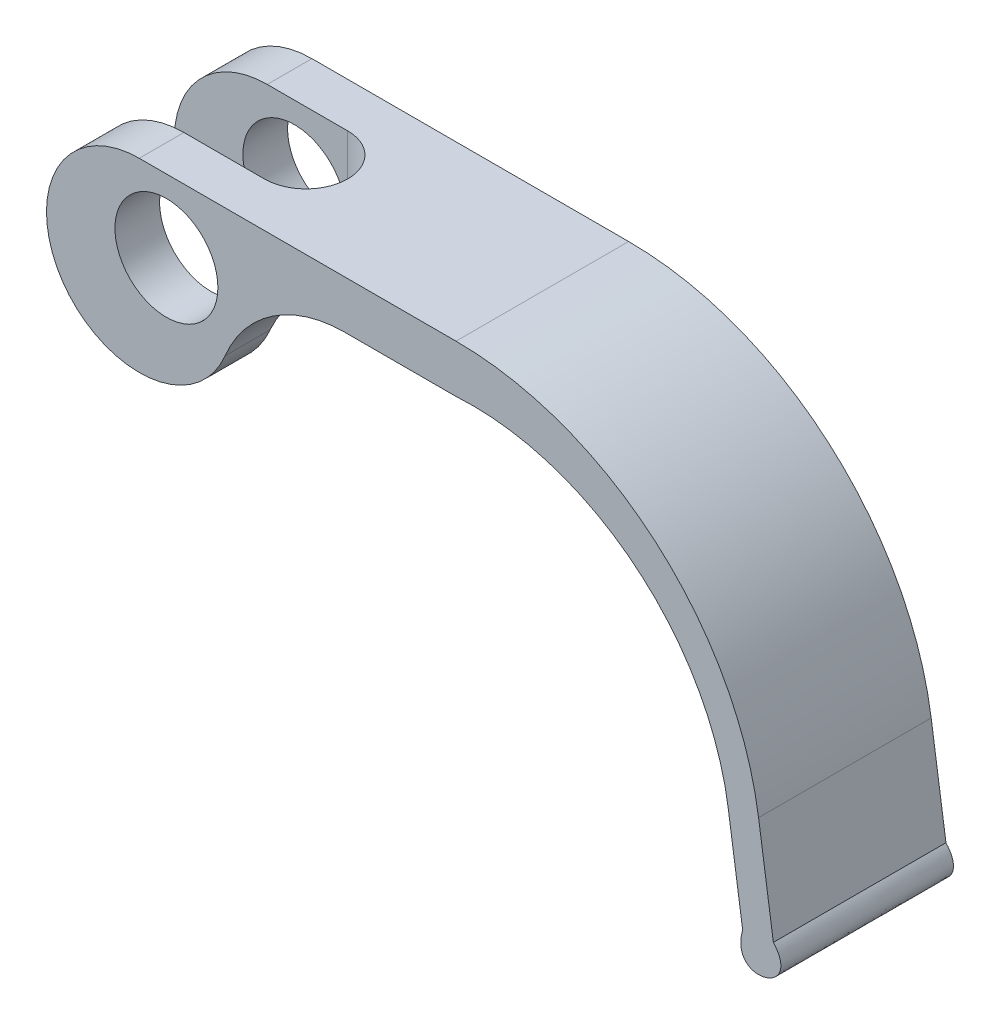
ISO-10303-21;
HEADER;
FILE_DESCRIPTION(('STEP AP214'),'2;1');
FILE_NAME('part.step','',(''),(''),'','','');
FILE_SCHEMA(('AUTOMOTIVE_DESIGN { 1 0 10303 214 1 1 1 1 }'));
ENDSEC;
DATA;
#1=APPLICATION_CONTEXT('core data for automotive mechanical design processes');
#2=APPLICATION_PROTOCOL_DEFINITION('international standard','automotive_design',2000,#1);
#3=PRODUCT_CONTEXT('',#1,'mechanical');
#4=PRODUCT('Part','Part','',(#3));
#5=PRODUCT_RELATED_PRODUCT_CATEGORY('part','',(#4));
#6=PRODUCT_DEFINITION_FORMATION('','',#4);
#7=PRODUCT_DEFINITION_CONTEXT('part definition',#1,'design');
#8=PRODUCT_DEFINITION('design','',#6,#7);
#9=PRODUCT_DEFINITION_SHAPE('','',#8);
#10=(LENGTH_UNIT() NAMED_UNIT(*) SI_UNIT(.MILLI.,.METRE.));
#11=(NAMED_UNIT(*) PLANE_ANGLE_UNIT() SI_UNIT($,.RADIAN.));
#12=(NAMED_UNIT(*) SI_UNIT($,.STERADIAN.) SOLID_ANGLE_UNIT());
#13=UNCERTAINTY_MEASURE_WITH_UNIT(LENGTH_MEASURE(1.E-05),#10,'distance_accuracy_value','');
#14=(GEOMETRIC_REPRESENTATION_CONTEXT(3) GLOBAL_UNCERTAINTY_ASSIGNED_CONTEXT((#13)) GLOBAL_UNIT_ASSIGNED_CONTEXT((#10,
#11,#12)) REPRESENTATION_CONTEXT('',''));
#15=CARTESIAN_POINT('',(0.,0.,0.));
#16=DIRECTION('',(0.,0.,1.));
#17=DIRECTION('',(1.,0.,0.));
#18=AXIS2_PLACEMENT_3D('',#15,#16,#17);
#19=CARTESIAN_POINT('',(-2.17476651410266,-1.6129,13.843));
#20=DIRECTION('',(0.,0.,-1.));
#21=DIRECTION('',(-1.,0.,0.));
#22=AXIS2_PLACEMENT_3D('',#19,#20,#21);
#23=CYLINDRICAL_SURFACE('',#22,7.4422);
#24=CARTESIAN_POINT('',(-2.17476651410266,-1.6129,3.5814));
#25=DIRECTION('',(0.,0.,-1.));
#26=DIRECTION('',(-1.,0.,0.));
#27=AXIS2_PLACEMENT_3D('',#24,#25,#26);
#28=CIRCLE('',#27,7.4422);
#29=CARTESIAN_POINT('',(4.27683348589735,-5.3227784724031,3.5814));
#30=VERTEX_POINT('',#29);
#31=CARTESIAN_POINT('',(-2.17476651410277,5.8293,3.5814));
#32=VERTEX_POINT('',#31);
#33=EDGE_CURVE('E216',#30,#32,#28,.T.);
#34=ORIENTED_EDGE('',*,*,#33,.T.);
#35=DIRECTION('',(0.,0.,-1.));
#36=VECTOR('',#35,1.);
#37=CARTESIAN_POINT('',(-2.17476651410277,5.8293,13.843));
#38=LINE('',#37,#36);
#39=CARTESIAN_POINT('',(-2.17476651410277,5.8293,0.));
#40=VERTEX_POINT('',#39);
#41=EDGE_CURVE('E100',#32,#40,#38,.T.);
#42=ORIENTED_EDGE('',*,*,#41,.T.);
#43=CARTESIAN_POINT('',(-2.17476651410266,-1.6129,0.));
#44=DIRECTION('',(0.,0.,1.));
#45=DIRECTION('',(1.,0.,0.));
#46=AXIS2_PLACEMENT_3D('',#43,#44,#45);
#47=CIRCLE('',#46,7.4422);
#48=CARTESIAN_POINT('',(4.70535823979086,-4.45019170351971,0.));
#49=VERTEX_POINT('',#48);
#50=EDGE_CURVE('E155',#40,#49,#47,.T.);
#51=ORIENTED_EDGE('',*,*,#50,.T.);
#52=DIRECTION('',(0.,0.,-1.));
#53=VECTOR('',#52,1.);
#54=CARTESIAN_POINT('',(4.70535823979086,-4.45019170351971,13.843));
#55=LINE('',#54,#53);
#56=CARTESIAN_POINT('',(4.70535823979086,-4.45019170351971,3.60900327618267));
#57=VERTEX_POINT('',#56);
#58=EDGE_CURVE('E46',#57,#49,#55,.T.);
#59=ORIENTED_EDGE('',*,*,#58,.F.);
#60=CARTESIAN_POINT('',(4.70535823979085,-4.45019170351971,3.60900327618267));
#61=CARTESIAN_POINT('',(4.67445558624973,-4.52512840064836,3.60500735494931));
#62=CARTESIAN_POINT('',(4.64232187877943,-4.59957434724428,3.60128820361471));
#63=CARTESIAN_POINT('',(4.57566623917632,-4.74731487955075,3.59462600998888));
#64=CARTESIAN_POINT('',(4.54114726173133,-4.82061075645247,3.5916820284868));
#65=CARTESIAN_POINT('',(4.46971895113529,-4.96606536485535,3.58678191159321));
#66=CARTESIAN_POINT('',(4.43280957676746,-5.03822407672209,3.58482579324019));
#67=CARTESIAN_POINT('',(4.35659797339667,-5.1814020474658,3.58213508059393));
#68=CARTESIAN_POINT('',(4.31729288249164,-5.25241981020556,3.5814019781697));
#69=CARTESIAN_POINT('',(4.27683348589735,-5.3227784724031,3.5814));
#70=B_SPLINE_CURVE_WITH_KNOTS('',3,(#60,#61,#62,#63,#64,#65,#66,#67,#68,#69),.UNSPECIFIED.,.F.,
.F.,(4,2,2,2,4),(0.,0.243462483393196,0.486628611198417,0.729798932947604,0.973265664340483),.UNSPECIFIED.);
#71=EDGE_CURVE('E247',#57,#30,#70,.T.);
#72=ORIENTED_EDGE('',*,*,#71,.T.);
#73=EDGE_LOOP('',(#34,#42,#51,#59,#72));
#74=FACE_BOUND('',#73,.T.);
#75=ADVANCED_FACE('F36',(#74),#23,.T.);
#76=CARTESIAN_POINT('',(0.,0.,13.843));
#77=DIRECTION('',(0.,0.,-1.));
#78=DIRECTION('',(-1.,0.,0.));
#79=AXIS2_PLACEMENT_3D('',#76,#77,#78);
#80=CYLINDRICAL_SURFACE('',#79,4.1275);
#81=CARTESIAN_POINT('',(0.,0.,3.5814));
#82=DIRECTION('',(0.,0.,-1.));
#83=DIRECTION('',(-1.,0.,0.));
#84=AXIS2_PLACEMENT_3D('',#81,#82,#83);
#85=CIRCLE('',#84,4.1275);
#86=CARTESIAN_POINT('',(-4.1275,0.,3.5814));
#87=VERTEX_POINT('',#86);
#88=EDGE_CURVE('E41',#87,#87,#85,.T.);
#89=ORIENTED_EDGE('',*,*,#88,.F.);
#90=EDGE_LOOP('',(#89));
#91=FACE_BOUND('',#90,.T.);
#92=CARTESIAN_POINT('',(0.,0.,0.));
#93=DIRECTION('',(0.,0.,1.));
#94=DIRECTION('',(1.,0.,0.));
#95=AXIS2_PLACEMENT_3D('',#92,#93,#94);
#96=CIRCLE('',#95,4.1275);
#97=CARTESIAN_POINT('',(4.1275,0.,0.));
#98=VERTEX_POINT('',#97);
#99=EDGE_CURVE('E254',#98,#98,#96,.T.);
#100=ORIENTED_EDGE('',*,*,#99,.F.);
#101=EDGE_LOOP('',(#100));
#102=FACE_BOUND('',#101,.T.);
#103=ADVANCED_FACE('F293',(#91,#102),#80,.F.);
#104=CARTESIAN_POINT('',(-2.17476651410266,-1.6129,13.843));
#105=DIRECTION('',(0.,0.,1.));
#106=DIRECTION('',(1.,0.,0.));
#107=AXIS2_PLACEMENT_3D('',#104,#105,#106);
#108=PLANE('',#107);
#109=CARTESIAN_POINT('',(-2.17476651410266,-1.6129,13.843));
#110=DIRECTION('',(0.,0.,1.));
#111=DIRECTION('',(1.,0.,0.));
#112=AXIS2_PLACEMENT_3D('',#109,#110,#111);
#113=CIRCLE('',#112,7.4422);
#114=CARTESIAN_POINT('',(-2.17476651410277,5.8293,13.843));
#115=VERTEX_POINT('',#114);
#116=CARTESIAN_POINT('',(4.70535823979086,-4.45019170351971,13.843));
#117=VERTEX_POINT('',#116);
#118=EDGE_CURVE('E178',#115,#117,#113,.T.);
#119=ORIENTED_EDGE('',*,*,#118,.T.);
#120=CARTESIAN_POINT('',(14.3234469572827,-8.41659119451921,13.843));
#121=DIRECTION('',(0.,0.,-1.));
#122=DIRECTION('',(-1.,0.,0.));
#123=AXIS2_PLACEMENT_3D('',#120,#121,#122);
#124=CIRCLE('',#123,10.4038433042672);
#125=CARTESIAN_POINT('',(14.3234469572827,1.98725210974799,13.843));
#126=VERTEX_POINT('',#125);
#127=EDGE_CURVE('E108',#117,#126,#124,.T.);
#128=ORIENTED_EDGE('',*,*,#127,.T.);
#129=DIRECTION('',(1.,0.,0.));
#130=VECTOR('',#129,1.);
#131=CARTESIAN_POINT('',(14.3234469572827,1.98725210974799,13.843));
#132=LINE('',#131,#130);
#133=CARTESIAN_POINT('',(23.2252334858973,1.98725210974799,13.843));
#134=VERTEX_POINT('',#133);
#135=EDGE_CURVE('E261',#126,#134,#132,.T.);
#136=ORIENTED_EDGE('',*,*,#135,.T.);
#137=CARTESIAN_POINT('',(24.5407161804484,-18.7063089307101,13.843));
#138=DIRECTION('',(0.,0.,-1.));
#139=DIRECTION('',(1.,0.,0.));
#140=AXIS2_PLACEMENT_3D('',#137,#138,#139);
#141=CIRCLE('',#140,20.7353312791195);
#142=CARTESIAN_POINT('',(45.0558500981308,-15.692466931801,13.843));
#143=VERTEX_POINT('',#142);
#144=EDGE_CURVE('E263',#134,#143,#141,.T.);
#145=ORIENTED_EDGE('',*,*,#144,.T.);
#146=DIRECTION('',(0.145348147967335,-0.989380571813731,0.));
#147=VECTOR('',#146,1.);
#148=CARTESIAN_POINT('',(46.2123460088835,-23.5647006099203,13.843));
#149=LINE('',#148,#147);
#150=CARTESIAN_POINT('',(46.2123460088835,-23.5647006099203,13.843));
#151=VERTEX_POINT('',#150);
#152=EDGE_CURVE('E265',#143,#151,#149,.T.);
#153=ORIENTED_EDGE('',*,*,#152,.T.);
#154=CARTESIAN_POINT('',(46.2123460088835,-23.5647006099203,13.843));
#155=CARTESIAN_POINT('',(45.0568770991267,-27.6818498573623,13.843));
#156=CARTESIAN_POINT('',(51.1701619956462,-26.00678911385,13.843));
#157=CARTESIAN_POINT('',(48.6751121282422,-23.2029,13.843));
#158=B_SPLINE_CURVE_WITH_KNOTS('',3,(#154,#155,#156,#157),.UNSPECIFIED.,.F.,.F.,(4,4),(0.,1.),.UNSPECIFIED.);
#159=CARTESIAN_POINT('',(48.6751121282422,-23.2029,13.843));
#160=VERTEX_POINT('',#159);
#161=EDGE_CURVE('E134',#151,#160,#158,.T.);
#162=ORIENTED_EDGE('',*,*,#161,.T.);
#163=DIRECTION('',(-0.145348147967335,0.989380571813731,0.));
#164=VECTOR('',#163,1.);
#165=CARTESIAN_POINT('',(48.6751121282422,-23.2029,13.843));
#166=LINE('',#165,#164);
#167=CARTESIAN_POINT('',(47.4892158643907,-15.1305389823359,13.843));
#168=VERTEX_POINT('',#167);
#169=EDGE_CURVE('E126',#160,#168,#166,.T.);
#170=ORIENTED_EDGE('',*,*,#169,.T.);
#171=CARTESIAN_POINT('',(23.2252334858973,-18.695117670758,13.843));
#172=DIRECTION('',(0.,0.,1.));
#173=DIRECTION('',(1.,0.,0.));
#174=AXIS2_PLACEMENT_3D('',#171,#172,#173);
#175=CIRCLE('',#174,24.524417670758);
#176=CARTESIAN_POINT('',(23.2252334858973,5.8293,13.843));
#177=VERTEX_POINT('',#176);
#178=EDGE_CURVE('E131',#168,#177,#175,.T.);
#179=ORIENTED_EDGE('',*,*,#178,.T.);
#180=DIRECTION('',(-1.,0.,0.));
#181=VECTOR('',#180,1.);
#182=CARTESIAN_POINT('',(-2.17476651410277,5.8293,13.843));
#183=LINE('',#182,#181);
#184=EDGE_CURVE('E63',#177,#115,#183,.T.);
#185=ORIENTED_EDGE('',*,*,#184,.T.);
#186=EDGE_LOOP('',(#119,#128,#136,#145,#153,#162,#170,#179,#185));
#187=FACE_BOUND('',#186,.T.);
#188=CARTESIAN_POINT('',(0.,0.,13.843));
#189=DIRECTION('',(0.,0.,1.));
#190=DIRECTION('',(1.,0.,0.));
#191=AXIS2_PLACEMENT_3D('',#188,#189,#190);
#192=CIRCLE('',#191,4.1275);
#193=CARTESIAN_POINT('',(4.1275,0.,13.843));
#194=VERTEX_POINT('',#193);
#195=EDGE_CURVE('E158',#194,#194,#192,.T.);
#196=ORIENTED_EDGE('',*,*,#195,.F.);
#197=EDGE_LOOP('',(#196));
#198=FACE_BOUND('',#197,.T.);
#199=ADVANCED_FACE('F128',(#187,#198),#108,.T.);
#200=CARTESIAN_POINT('',(-2.17476651410266,-1.6129,0.));
#201=DIRECTION('',(0.,0.,1.));
#202=DIRECTION('',(1.,0.,0.));
#203=AXIS2_PLACEMENT_3D('',#200,#201,#202);
#204=PLANE('',#203);
#205=ORIENTED_EDGE('',*,*,#50,.F.);
#206=DIRECTION('',(-1.,0.,0.));
#207=VECTOR('',#206,1.);
#208=CARTESIAN_POINT('',(-2.17476651410277,5.8293,0.));
#209=LINE('',#208,#207);
#210=CARTESIAN_POINT('',(23.2252334858973,5.8293,0.));
#211=VERTEX_POINT('',#210);
#212=EDGE_CURVE('E176',#211,#40,#209,.T.);
#213=ORIENTED_EDGE('',*,*,#212,.F.);
#214=CARTESIAN_POINT('',(23.2252334858973,-18.695117670758,0.));
#215=DIRECTION('',(0.,0.,1.));
#216=DIRECTION('',(1.,0.,0.));
#217=AXIS2_PLACEMENT_3D('',#214,#215,#216);
#218=CIRCLE('',#217,24.524417670758);
#219=CARTESIAN_POINT('',(47.4892158643907,-15.1305389823359,0.));
#220=VERTEX_POINT('',#219);
#221=EDGE_CURVE('E174',#220,#211,#218,.T.);
#222=ORIENTED_EDGE('',*,*,#221,.F.);
#223=DIRECTION('',(-0.145348147967335,0.989380571813731,0.));
#224=VECTOR('',#223,1.);
#225=CARTESIAN_POINT('',(48.6751121282422,-23.2029,0.));
#226=LINE('',#225,#224);
#227=CARTESIAN_POINT('',(48.6751121282422,-23.2029,0.));
#228=VERTEX_POINT('',#227);
#229=EDGE_CURVE('E143',#228,#220,#226,.T.);
#230=ORIENTED_EDGE('',*,*,#229,.F.);
#231=CARTESIAN_POINT('',(46.2123460088835,-23.5647006099203,0.));
#232=CARTESIAN_POINT('',(45.0568770991267,-27.6818498573623,0.));
#233=CARTESIAN_POINT('',(51.1701619956462,-26.00678911385,0.));
#234=CARTESIAN_POINT('',(48.6751121282422,-23.2029,0.));
#235=B_SPLINE_CURVE_WITH_KNOTS('',3,(#231,#232,#233,#234),.UNSPECIFIED.,.F.,.F.,(4,4),(0.,1.),.UNSPECIFIED.);
#236=CARTESIAN_POINT('',(46.2123460088835,-23.5647006099203,0.));
#237=VERTEX_POINT('',#236);
#238=EDGE_CURVE('E166',#237,#228,#235,.T.);
#239=ORIENTED_EDGE('',*,*,#238,.F.);
#240=DIRECTION('',(0.145348147967335,-0.989380571813731,0.));
#241=VECTOR('',#240,1.);
#242=CARTESIAN_POINT('',(46.2123460088835,-23.5647006099203,0.));
#243=LINE('',#242,#241);
#244=CARTESIAN_POINT('',(45.0558500981308,-15.692466931801,0.));
#245=VERTEX_POINT('',#244);
#246=EDGE_CURVE('E164',#245,#237,#243,.T.);
#247=ORIENTED_EDGE('',*,*,#246,.F.);
#248=CARTESIAN_POINT('',(24.5407161804484,-18.7063089307101,0.));
#249=DIRECTION('',(0.,0.,-1.));
#250=DIRECTION('',(1.,0.,0.));
#251=AXIS2_PLACEMENT_3D('',#248,#249,#250);
#252=CIRCLE('',#251,20.7353312791195);
#253=CARTESIAN_POINT('',(23.2252334858973,1.98725210974799,0.));
#254=VERTEX_POINT('',#253);
#255=EDGE_CURVE('E162',#254,#245,#252,.T.);
#256=ORIENTED_EDGE('',*,*,#255,.F.);
#257=DIRECTION('',(1.,0.,0.));
#258=VECTOR('',#257,1.);
#259=CARTESIAN_POINT('',(14.3234469572827,1.98725210974799,0.));
#260=LINE('',#259,#258);
#261=CARTESIAN_POINT('',(14.3234469572827,1.98725210974799,0.));
#262=VERTEX_POINT('',#261);
#263=EDGE_CURVE('E160',#262,#254,#260,.T.);
#264=ORIENTED_EDGE('',*,*,#263,.F.);
#265=CARTESIAN_POINT('',(14.3234469572827,-8.41659119451921,0.));
#266=DIRECTION('',(0.,0.,-1.));
#267=DIRECTION('',(-1.,0.,0.));
#268=AXIS2_PLACEMENT_3D('',#265,#266,#267);
#269=CIRCLE('',#268,10.4038433042672);
#270=EDGE_CURVE('E157',#49,#262,#269,.T.);
#271=ORIENTED_EDGE('',*,*,#270,.F.);
#272=EDGE_LOOP('',(#205,#213,#222,#230,#239,#247,#256,#264,#271));
#273=FACE_BOUND('',#272,.T.);
#274=ORIENTED_EDGE('',*,*,#99,.T.);
#275=EDGE_LOOP('',(#274));
#276=FACE_BOUND('',#275,.T.);
#277=ADVANCED_FACE('F299',(#273,#276),#204,.F.);
#278=CARTESIAN_POINT('',(-2.17476651410266,-1.6129,10.2616));
#279=DIRECTION('',(0.,0.,1.));
#280=DIRECTION('',(1.,0.,0.));
#281=AXIS2_PLACEMENT_3D('',#278,#279,#280);
#282=CIRCLE('',#281,7.4422);
#283=CARTESIAN_POINT('',(-2.17476651410277,5.8293,10.2616));
#284=VERTEX_POINT('',#283);
#285=CARTESIAN_POINT('',(4.27683348589735,-5.3227784724031,10.2616));
#286=VERTEX_POINT('',#285);
#287=EDGE_CURVE('E54',#284,#286,#282,.T.);
#288=ORIENTED_EDGE('',*,*,#287,.T.);
#289=CARTESIAN_POINT('',(4.27683348589735,-5.3227784724031,10.2616));
#290=CARTESIAN_POINT('',(4.31729288249163,-5.25241981020556,10.2615980218303));
#291=CARTESIAN_POINT('',(4.35659797339666,-5.1814020474658,10.2608649194061));
#292=CARTESIAN_POINT('',(4.43280957676746,-5.03822407672209,10.2581742067598));
#293=CARTESIAN_POINT('',(4.46971895113528,-4.96606536485535,10.2562180884068));
#294=CARTESIAN_POINT('',(4.54114726173133,-4.82061075645247,10.2513179715132));
#295=CARTESIAN_POINT('',(4.57566623917632,-4.74731487955075,10.2483739900111));
#296=CARTESIAN_POINT('',(4.64232187877943,-4.59957434724428,10.2417117963853));
#297=CARTESIAN_POINT('',(4.67445558624973,-4.52512840064836,10.2379926450507));
#298=CARTESIAN_POINT('',(4.70535823979085,-4.45019170351971,10.2339967238173));
#299=B_SPLINE_CURVE_WITH_KNOTS('',3,(#289,#290,#291,#292,#293,#294,#295,#296,#297,#298),
.UNSPECIFIED.,.F.,.F.,(4,2,2,2,4),(0.,0.24346673139288,0.486637053142068,0.729803180947288,
0.973265664340484),.UNSPECIFIED.);
#300=CARTESIAN_POINT('',(4.70535823979086,-4.45019170351971,10.2339967238173));
#301=VERTEX_POINT('',#300);
#302=EDGE_CURVE('E226',#286,#301,#299,.T.);
#303=ORIENTED_EDGE('',*,*,#302,.T.);
#304=EDGE_CURVE('E11',#117,#301,#55,.T.);
#305=ORIENTED_EDGE('',*,*,#304,.F.);
#306=ORIENTED_EDGE('',*,*,#118,.F.);
#307=EDGE_CURVE('E179',#115,#284,#38,.T.);
#308=ORIENTED_EDGE('',*,*,#307,.T.);
#309=EDGE_LOOP('',(#288,#303,#305,#306,#308));
#310=FACE_BOUND('',#309,.T.);
#311=ADVANCED_FACE('F38',(#310),#23,.T.);
#312=CARTESIAN_POINT('',(14.3234469572827,-8.41659119451921,13.843));
#313=DIRECTION('',(0.,0.,-1.));
#314=DIRECTION('',(-1.,0.,0.));
#315=AXIS2_PLACEMENT_3D('',#312,#313,#314);
#316=CYLINDRICAL_SURFACE('',#315,10.4038433042672);
#317=ORIENTED_EDGE('',*,*,#304,.T.);
#318=CARTESIAN_POINT('',(4.70535823979086,-4.45019170351971,10.2339967238173));
#319=CARTESIAN_POINT('',(4.74642729884532,-4.35060271929933,10.2286787959311));
#320=CARTESIAN_POINT('',(4.78902353840307,-4.25170268569276,10.2223971103958));
#321=CARTESIAN_POINT('',(4.87720620583366,-4.05538976387854,10.2075047502878));
#322=CARTESIAN_POINT('',(4.9227934943426,-3.95797731373142,10.1988934031388));
#323=CARTESIAN_POINT('',(5.06435091150698,-3.66731300757112,10.168873794861));
#324=CARTESIAN_POINT('',(5.1647290252874,-3.47657349945795,10.1433223407196));
#325=CARTESIAN_POINT('',(5.37750865460273,-3.10081761264667,10.0770330228441));
#326=CARTESIAN_POINT('',(5.49006519137795,-2.91592654081512,10.0360774913109));
#327=CARTESIAN_POINT('',(5.72362835020561,-2.55753104322496,9.9346733866757));
#328=CARTESIAN_POINT('',(5.84461391458656,-2.38400020373922,9.8742721155649));
#329=CARTESIAN_POINT('',(6.02694152603881,-2.13823342410098,9.76720463898202));
#330=CARTESIAN_POINT('',(6.08639026373984,-2.06047854553927,9.72987191767751));
#331=CARTESIAN_POINT('',(6.20584393151884,-1.9086093371994,9.64920856918747));
#332=CARTESIAN_POINT('',(6.26584888831561,-1.83449518339736,9.60587765246211));
#333=CARTESIAN_POINT('',(6.44536261581616,-1.61876691171805,9.46641729822684));
#334=CARTESIAN_POINT('',(6.56487872855206,-1.48308812664301,9.36053637422303));
#335=CARTESIAN_POINT('',(6.73940638766255,-1.29409859611899,9.17963527008987));
#336=CARTESIAN_POINT('',(6.79719815173124,-1.23313026971908,9.11509673720053));
#337=CARTESIAN_POINT('',(6.90976989183601,-1.11701248617833,8.97861615791872));
#338=CARTESIAN_POINT('',(6.96455175091577,-1.06185937063376,8.90667882314378));
#339=CARTESIAN_POINT('',(7.06988291777203,-0.957955515619331,8.75551710038761));
#340=CARTESIAN_POINT('',(7.12043488188467,-0.909200746941539,8.67629735230804));
#341=CARTESIAN_POINT('',(7.21605607967422,-0.818612089231905,8.5109542437267));
#342=CARTESIAN_POINT('',(7.26112767476696,-0.776775216556795,8.42483388333152));
#343=CARTESIAN_POINT('',(7.36234143012627,-0.684225584413059,8.20820215680031));
#344=CARTESIAN_POINT('',(7.41503742591229,-0.63730725000764,8.07439078877775));
#345=CARTESIAN_POINT('',(7.50346904935467,-0.559660754451894,7.79688190890354));
#346=CARTESIAN_POINT('',(7.53921289118458,-0.528924751349229,7.65318922377561));
#347=CARTESIAN_POINT('',(7.59147622805668,-0.484269330317971,7.3593627408908));
#348=CARTESIAN_POINT('',(7.60794387742064,-0.470395260808853,7.20921269323812));
#349=CARTESIAN_POINT('',(7.62031444131217,-0.459955910377952,6.90747032123069));
#350=CARTESIAN_POINT('',(7.6162192452407,-0.463389039197908,6.75587813066362));
#351=CARTESIAN_POINT('',(7.58842770073896,-0.486915099811281,6.46295522740245));
#352=CARTESIAN_POINT('',(7.56564301376714,-0.506233274979387,6.32147350420746));
#353=CARTESIAN_POINT('',(7.50308788275729,-0.560106972376134,6.04537809656664));
#354=CARTESIAN_POINT('',(7.46331826721009,-0.594661751396384,5.91076407748643));
#355=CARTESIAN_POINT('',(7.36806829927897,-0.679228250470647,5.64852851495129));
#356=CARTESIAN_POINT('',(7.31224155596766,-0.729583277696949,5.52114481931475));
#357=CARTESIAN_POINT('',(7.18849496943561,-0.844305119534896,5.2792517252193));
#358=CARTESIAN_POINT('',(7.12057047447675,-0.908677326055746,5.16474730673498));
#359=CARTESIAN_POINT('',(6.9686200378321,-1.05731984865616,4.93883687130914));
#360=CARTESIAN_POINT('',(6.88365583240872,-1.14295809118306,4.8289701938131));
#361=CARTESIAN_POINT('',(6.70763688419542,-1.32747057267586,4.62684404642332));
#362=CARTESIAN_POINT('',(6.61658270852852,-1.42634358002249,4.53458294010118));
#363=CARTESIAN_POINT('',(6.45192079423105,-1.61283847476908,4.38479709516146));
#364=CARTESIAN_POINT('',(6.37875874659,-1.69832668045557,4.32406603235815));
#365=CARTESIAN_POINT('',(6.23237979123568,-1.87535453050694,4.2121461882983));
#366=CARTESIAN_POINT('',(6.1591628742319,-1.96689712825638,4.16096211134829));
#367=CARTESIAN_POINT('',(6.01348779430503,-2.15569393063162,4.06705531461919));
#368=CARTESIAN_POINT('',(5.94103605897599,-2.25297689894615,4.02438090906032));
#369=CARTESIAN_POINT('',(5.7982011476349,-2.4520990157728,3.94688899492921));
#370=CARTESIAN_POINT('',(5.72781860001345,-2.55393952515647,3.91207385212649));
#371=CARTESIAN_POINT('',(5.5662086848063,-2.79709805033944,3.83862148431605));
#372=CARTESIAN_POINT('',(5.47609501330904,-2.93999419726734,3.80275683997243));
#373=CARTESIAN_POINT('',(5.30203197395651,-3.23171594048437,3.74128692238645));
#374=CARTESIAN_POINT('',(5.21808737034348,-3.38054598538184,3.71568951169964));
#375=CARTESIAN_POINT('',(5.05843652114359,-3.68077196736445,3.673099684101));
#376=CARTESIAN_POINT('',(4.98262444036851,-3.83209450883101,3.65598237607728));
#377=CARTESIAN_POINT('',(4.83838940498677,-4.13846629563026,3.62813782412014));
#378=CARTESIAN_POINT('',(4.76995323786022,-4.29350824784121,3.61739899324276));
#379=CARTESIAN_POINT('',(4.70535823979086,-4.45019170351971,3.60900327618267));
#380=B_SPLINE_CURVE_WITH_KNOTS('',3,(#318,#319,#320,#321,#322,#323,#324,#325,#326,#327,#328,
#329,#330,#331,#332,#333,#334,#335,#336,#337,#338,#339,#340,#341,#342,#343,#344,#345,#346,#347,
#348,#349,#350,#351,#352,#353,#354,#355,#356,#357,#358,#359,#360,#361,#362,#363,#364,#365,#366,
#367,#368,#369,#370,#371,#372,#373,#374,#375,#376,#377,#378,#379),.UNSPECIFIED.,.F.,.F.,(4,2,2,
2,2,2,2,2,2,2,2,2,2,2,2,2,2,2,2,2,2,2,2,2,2,2,2,2,2,2,4),(0.,0.323532002811014,
0.647157509572963,1.29745134953593,1.95730221108224,2.61555995389616,2.92960982167244,
3.24367485428869,3.86914318869663,4.18658128390187,4.5038184690534,4.82085491304465,
5.13775426261573,5.58945323651921,6.04093311530592,6.49362453444268,6.9462743591438,
7.37807186294265,7.80984830692815,8.25174503005252,8.69381203632044,9.18150176107748,
9.66914613323197,10.0522240421478,10.4354902180653,10.8208740583135,11.2063737513105,
11.7238610723711,12.2417439274407,12.7517543522339,13.2608354516913),.UNSPECIFIED.);
#381=EDGE_CURVE('E218',#301,#57,#380,.T.);
#382=ORIENTED_EDGE('',*,*,#381,.T.);
#383=ORIENTED_EDGE('',*,*,#58,.T.);
#384=ORIENTED_EDGE('',*,*,#270,.T.);
#385=DIRECTION('',(0.,0.,-1.));
#386=VECTOR('',#385,1.);
#387=CARTESIAN_POINT('',(14.3234469572827,1.98725210974799,13.843));
#388=LINE('',#387,#386);
#389=EDGE_CURVE('E193',#126,#262,#388,.T.);
#390=ORIENTED_EDGE('',*,*,#389,.F.);
#391=ORIENTED_EDGE('',*,*,#127,.F.);
#392=EDGE_LOOP('',(#317,#382,#383,#384,#390,#391));
#393=FACE_BOUND('',#392,.T.);
#394=ADVANCED_FACE('F232',(#393),#316,.F.);
#395=CARTESIAN_POINT('',(14.3234469572827,1.98725210974799,13.843));
#396=DIRECTION('',(0.,1.,0.));
#397=DIRECTION('',(0.,0.,1.));
#398=AXIS2_PLACEMENT_3D('',#395,#396,#397);
#399=PLANE('',#398);
#400=ORIENTED_EDGE('',*,*,#263,.T.);
#401=DIRECTION('',(0.,0.,-1.));
#402=VECTOR('',#401,1.);
#403=CARTESIAN_POINT('',(23.2252334858973,1.98725210974799,13.843));
#404=LINE('',#403,#402);
#405=EDGE_CURVE('E190',#134,#254,#404,.T.);
#406=ORIENTED_EDGE('',*,*,#405,.F.);
#407=ORIENTED_EDGE('',*,*,#135,.F.);
#408=ORIENTED_EDGE('',*,*,#389,.T.);
#409=EDGE_LOOP('',(#400,#406,#407,#408));
#410=FACE_BOUND('',#409,.T.);
#411=ADVANCED_FACE('F285',(#410),#399,.F.);
#412=CARTESIAN_POINT('',(24.5407161804484,-18.7063089307101,13.843));
#413=DIRECTION('',(0.,0.,-1.));
#414=DIRECTION('',(-1.,0.,0.));
#415=AXIS2_PLACEMENT_3D('',#412,#413,#414);
#416=CYLINDRICAL_SURFACE('',#415,20.7353312791195);
#417=ORIENTED_EDGE('',*,*,#255,.T.);
#418=DIRECTION('',(0.,0.,-1.));
#419=VECTOR('',#418,1.);
#420=CARTESIAN_POINT('',(45.0558500981308,-15.692466931801,13.843));
#421=LINE('',#420,#419);
#422=EDGE_CURVE('E187',#143,#245,#421,.T.);
#423=ORIENTED_EDGE('',*,*,#422,.F.);
#424=ORIENTED_EDGE('',*,*,#144,.F.);
#425=ORIENTED_EDGE('',*,*,#405,.T.);
#426=EDGE_LOOP('',(#417,#423,#424,#425));
#427=FACE_BOUND('',#426,.T.);
#428=ADVANCED_FACE('F282',(#427),#416,.F.);
#429=CARTESIAN_POINT('',(46.2123460088835,-23.5647006099203,13.843));
#430=DIRECTION('',(0.989380571813731,0.145348147967335,0.));
#431=DIRECTION('',(-0.145348147967335,0.989380571813731,0.));
#432=AXIS2_PLACEMENT_3D('',#429,#430,#431);
#433=PLANE('',#432);
#434=ORIENTED_EDGE('',*,*,#246,.T.);
#435=DIRECTION('',(0.,0.,-1.));
#436=VECTOR('',#435,1.);
#437=CARTESIAN_POINT('',(46.2123460088835,-23.5647006099203,13.843));
#438=LINE('',#437,#436);
#439=EDGE_CURVE('E184',#151,#237,#438,.T.);
#440=ORIENTED_EDGE('',*,*,#439,.F.);
#441=ORIENTED_EDGE('',*,*,#152,.F.);
#442=ORIENTED_EDGE('',*,*,#422,.T.);
#443=EDGE_LOOP('',(#434,#440,#441,#442));
#444=FACE_BOUND('',#443,.T.);
#445=ADVANCED_FACE('F277',(#444),#433,.F.);
#446=DIRECTION('',(0.,0.,-1.));
#447=VECTOR('',#446,1.);
#448=SURFACE_OF_LINEAR_EXTRUSION('',#158,#447);
#449=ORIENTED_EDGE('',*,*,#238,.T.);
#450=DIRECTION('',(0.,0.,-1.));
#451=VECTOR('',#450,1.);
#452=CARTESIAN_POINT('',(48.6751121282422,-23.2029,13.843));
#453=LINE('',#452,#451);
#454=EDGE_CURVE('E146',#160,#228,#453,.T.);
#455=ORIENTED_EDGE('',*,*,#454,.F.);
#456=ORIENTED_EDGE('',*,*,#161,.F.);
#457=ORIENTED_EDGE('',*,*,#439,.T.);
#458=EDGE_LOOP('',(#449,#455,#456,#457));
#459=FACE_BOUND('',#458,.T.);
#460=ADVANCED_FACE('F273',(#459),#448,.F.);
#461=CARTESIAN_POINT('',(48.6751121282422,-23.2029,13.843));
#462=DIRECTION('',(-0.989380571813731,-0.145348147967335,0.));
#463=DIRECTION('',(0.145348147967335,-0.989380571813731,0.));
#464=AXIS2_PLACEMENT_3D('',#461,#462,#463);
#465=PLANE('',#464);
#466=ORIENTED_EDGE('',*,*,#229,.T.);
#467=DIRECTION('',(0.,0.,-1.));
#468=VECTOR('',#467,1.);
#469=CARTESIAN_POINT('',(47.4892158643907,-15.1305389823359,13.843));
#470=LINE('',#469,#468);
#471=EDGE_CURVE('E140',#168,#220,#470,.T.);
#472=ORIENTED_EDGE('',*,*,#471,.F.);
#473=ORIENTED_EDGE('',*,*,#169,.F.);
#474=ORIENTED_EDGE('',*,*,#454,.T.);
#475=EDGE_LOOP('',(#466,#472,#473,#474));
#476=FACE_BOUND('',#475,.T.);
#477=ADVANCED_FACE('F141',(#476),#465,.F.);
#478=CARTESIAN_POINT('',(23.2252334858973,-18.695117670758,13.843));
#479=DIRECTION('',(0.,0.,-1.));
#480=DIRECTION('',(-1.,0.,0.));
#481=AXIS2_PLACEMENT_3D('',#478,#479,#480);
#482=CYLINDRICAL_SURFACE('',#481,24.524417670758);
#483=ORIENTED_EDGE('',*,*,#221,.T.);
#484=DIRECTION('',(0.,0.,-1.));
#485=VECTOR('',#484,1.);
#486=CARTESIAN_POINT('',(23.2252334858973,5.8293,13.843));
#487=LINE('',#486,#485);
#488=EDGE_CURVE('E147',#177,#211,#487,.T.);
#489=ORIENTED_EDGE('',*,*,#488,.F.);
#490=ORIENTED_EDGE('',*,*,#178,.F.);
#491=ORIENTED_EDGE('',*,*,#471,.T.);
#492=EDGE_LOOP('',(#483,#489,#490,#491));
#493=FACE_BOUND('',#492,.T.);
#494=ADVANCED_FACE('F149',(#493),#482,.T.);
#495=CARTESIAN_POINT('',(-2.17476651410277,5.8293,13.843));
#496=DIRECTION('',(0.,-1.,0.));
#497=DIRECTION('',(1.,0.,0.));
#498=AXIS2_PLACEMENT_3D('',#495,#496,#497);
#499=PLANE('',#498);
#500=ORIENTED_EDGE('',*,*,#41,.F.);
#501=DIRECTION('',(-1.,0.,0.));
#502=VECTOR('',#501,1.);
#503=CARTESIAN_POINT('',(4.27683348589735,5.8293,3.5814));
#504=LINE('',#503,#502);
#505=CARTESIAN_POINT('',(4.27683348589735,5.8293,3.5814));
#506=VERTEX_POINT('',#505);
#507=EDGE_CURVE('E211',#506,#32,#504,.T.);
#508=ORIENTED_EDGE('',*,*,#507,.F.);
#509=CARTESIAN_POINT('',(4.27683348589735,5.8293,6.9215));
#510=DIRECTION('',(0.,1.,0.));
#511=DIRECTION('',(-1.,0.,0.));
#512=AXIS2_PLACEMENT_3D('',#509,#510,#511);
#513=CIRCLE('',#512,3.3401);
#514=CARTESIAN_POINT('',(4.27683348589735,5.8293,10.2616));
#515=VERTEX_POINT('',#514);
#516=EDGE_CURVE('E321',#515,#506,#513,.T.);
#517=ORIENTED_EDGE('',*,*,#516,.F.);
#518=DIRECTION('',(1.,0.,0.));
#519=VECTOR('',#518,1.);
#520=CARTESIAN_POINT('',(4.27683348589735,5.8293,10.2616));
#521=LINE('',#520,#519);
#522=EDGE_CURVE('E317',#284,#515,#521,.T.);
#523=ORIENTED_EDGE('',*,*,#522,.F.);
#524=ORIENTED_EDGE('',*,*,#307,.F.);
#525=ORIENTED_EDGE('',*,*,#184,.F.);
#526=ORIENTED_EDGE('',*,*,#488,.T.);
#527=ORIENTED_EDGE('',*,*,#212,.T.);
#528=EDGE_LOOP('',(#500,#508,#517,#523,#524,#525,#526,#527));
#529=FACE_BOUND('',#528,.T.);
#530=ADVANCED_FACE('F324',(#529),#499,.F.);
#531=CARTESIAN_POINT('',(0.,0.,10.2616));
#532=DIRECTION('',(0.,0.,1.));
#533=DIRECTION('',(1.,0.,0.));
#534=AXIS2_PLACEMENT_3D('',#531,#532,#533);
#535=CIRCLE('',#534,4.1275);
#536=CARTESIAN_POINT('',(4.1275,0.,10.2616));
#537=VERTEX_POINT('',#536);
#538=EDGE_CURVE('E195',#537,#537,#535,.T.);
#539=ORIENTED_EDGE('',*,*,#538,.F.);
#540=EDGE_LOOP('',(#539));
#541=FACE_BOUND('',#540,.T.);
#542=ORIENTED_EDGE('',*,*,#195,.T.);
#543=EDGE_LOOP('',(#542));
#544=FACE_BOUND('',#543,.T.);
#545=ADVANCED_FACE('F241',(#541,#544),#80,.F.);
#546=CARTESIAN_POINT('',(4.27683348589735,-15.6337,6.9215));
#547=DIRECTION('',(0.,1.,0.));
#548=DIRECTION('',(-1.,0.,0.));
#549=AXIS2_PLACEMENT_3D('',#546,#547,#548);
#550=CYLINDRICAL_SURFACE('',#549,3.3401);
#551=ORIENTED_EDGE('',*,*,#381,.F.);
#552=ORIENTED_EDGE('',*,*,#302,.F.);
#553=DIRECTION('',(0.,1.,0.));
#554=VECTOR('',#553,1.);
#555=CARTESIAN_POINT('',(4.27683348589735,-15.6337,10.2616));
#556=LINE('',#555,#554);
#557=EDGE_CURVE('E202',#286,#515,#556,.T.);
#558=ORIENTED_EDGE('',*,*,#557,.T.);
#559=ORIENTED_EDGE('',*,*,#516,.T.);
#560=DIRECTION('',(0.,1.,0.));
#561=VECTOR('',#560,1.);
#562=CARTESIAN_POINT('',(4.27683348589735,-15.6337,3.5814));
#563=LINE('',#562,#561);
#564=EDGE_CURVE('E197',#30,#506,#563,.T.);
#565=ORIENTED_EDGE('',*,*,#564,.F.);
#566=ORIENTED_EDGE('',*,*,#71,.F.);
#567=EDGE_LOOP('',(#551,#552,#558,#559,#565,#566));
#568=FACE_BOUND('',#567,.T.);
#569=ADVANCED_FACE('F235',(#568),#550,.F.);
#570=CARTESIAN_POINT('',(4.27683348589735,-15.6337,3.5814));
#571=DIRECTION('',(0.,0.,-1.));
#572=DIRECTION('',(-1.,0.,0.));
#573=AXIS2_PLACEMENT_3D('',#570,#571,#572);
#574=PLANE('',#573);
#575=ORIENTED_EDGE('',*,*,#88,.T.);
#576=EDGE_LOOP('',(#575));
#577=FACE_BOUND('',#576,.T.);
#578=ORIENTED_EDGE('',*,*,#33,.F.);
#579=ORIENTED_EDGE('',*,*,#564,.T.);
#580=ORIENTED_EDGE('',*,*,#507,.T.);
#581=EDGE_LOOP('',(#578,#579,#580));
#582=FACE_BOUND('',#581,.T.);
#583=ADVANCED_FACE('F240',(#577,#582),#574,.F.);
#584=CARTESIAN_POINT('',(4.27683348589735,-15.6337,10.2616));
#585=DIRECTION('',(0.,0.,1.));
#586=DIRECTION('',(1.,0.,0.));
#587=AXIS2_PLACEMENT_3D('',#584,#585,#586);
#588=PLANE('',#587);
#589=ORIENTED_EDGE('',*,*,#538,.T.);
#590=EDGE_LOOP('',(#589));
#591=FACE_BOUND('',#590,.T.);
#592=ORIENTED_EDGE('',*,*,#522,.T.);
#593=ORIENTED_EDGE('',*,*,#557,.F.);
#594=ORIENTED_EDGE('',*,*,#287,.F.);
#595=EDGE_LOOP('',(#592,#593,#594));
#596=FACE_BOUND('',#595,.T.);
#597=ADVANCED_FACE('F243',(#591,#596),#588,.F.);
#598=CLOSED_SHELL('',(#75,#103,#199,#277,#311,#394,#411,#428,#445,#460,#477,#494,#530,#545,#569,
#583,#597));
#599=MANIFOLD_SOLID_BREP('B2',#598);
#600=ADVANCED_BREP_SHAPE_REPRESENTATION('',(#18,#599),#14);
#601=SHAPE_DEFINITION_REPRESENTATION(#9,#600);
ENDSEC;
END-ISO-10303-21;
